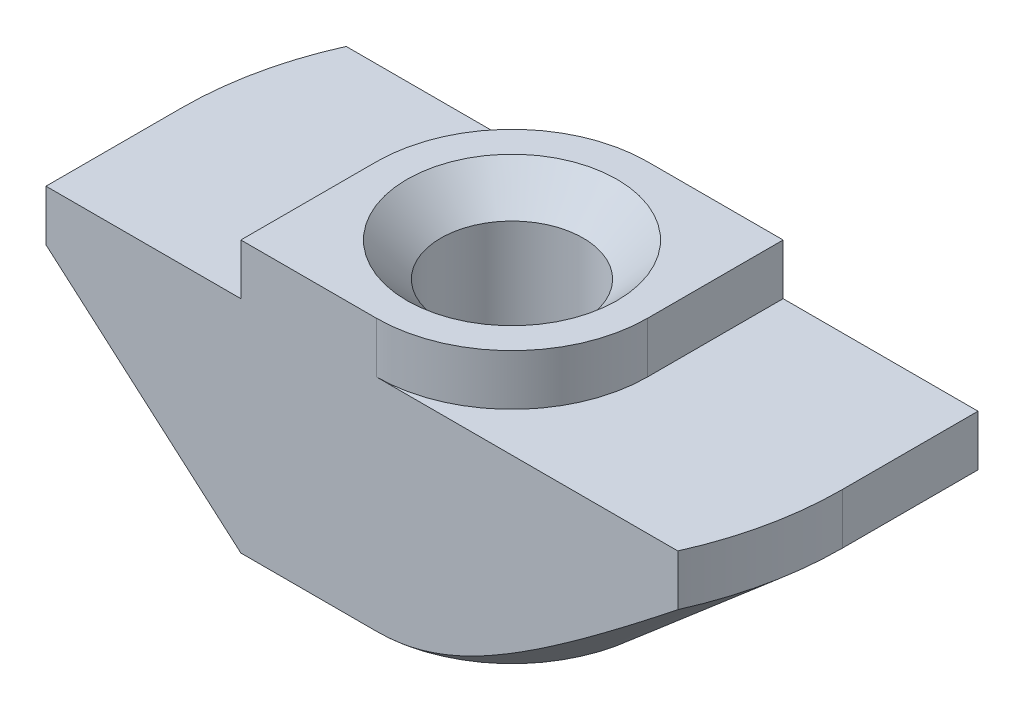
ISO-10303-21;
HEADER;
FILE_DESCRIPTION(('STEP AP214'),'2;1');
FILE_NAME('part.step','',(''),(''),'','','');
FILE_SCHEMA(('AUTOMOTIVE_DESIGN { 1 0 10303 214 1 1 1 1 }'));
ENDSEC;
DATA;
#1=APPLICATION_CONTEXT('core data for automotive mechanical design processes');
#2=APPLICATION_PROTOCOL_DEFINITION('international standard','automotive_design',2000,#1);
#3=PRODUCT_CONTEXT('',#1,'mechanical');
#4=PRODUCT('Part','Part','',(#3));
#5=PRODUCT_RELATED_PRODUCT_CATEGORY('part','',(#4));
#6=PRODUCT_DEFINITION_FORMATION('','',#4);
#7=PRODUCT_DEFINITION_CONTEXT('part definition',#1,'design');
#8=PRODUCT_DEFINITION('design','',#6,#7);
#9=PRODUCT_DEFINITION_SHAPE('','',#8);
#10=(LENGTH_UNIT() NAMED_UNIT(*) SI_UNIT(.MILLI.,.METRE.));
#11=(NAMED_UNIT(*) PLANE_ANGLE_UNIT() SI_UNIT($,.RADIAN.));
#12=(NAMED_UNIT(*) SI_UNIT($,.STERADIAN.) SOLID_ANGLE_UNIT());
#13=UNCERTAINTY_MEASURE_WITH_UNIT(LENGTH_MEASURE(1.E-05),#10,'distance_accuracy_value','');
#14=(GEOMETRIC_REPRESENTATION_CONTEXT(3) GLOBAL_UNCERTAINTY_ASSIGNED_CONTEXT((#13)) GLOBAL_UNIT_ASSIGNED_CONTEXT((#10,
#11,#12)) REPRESENTATION_CONTEXT('',''));
#15=CARTESIAN_POINT('',(0.,0.,0.));
#16=DIRECTION('',(0.,0.,1.));
#17=DIRECTION('',(1.,0.,0.));
#18=AXIS2_PLACEMENT_3D('',#15,#16,#17);
#19=CARTESIAN_POINT('',(-9.75,-1.5,4.));
#20=DIRECTION('',(1.,0.,0.));
#21=DIRECTION('',(0.,0.,-1.));
#22=AXIS2_PLACEMENT_3D('',#19,#20,#21);
#23=PLANE('',#22);
#24=DIRECTION('',(0.,0.,-1.));
#25=VECTOR('',#24,1.);
#26=CARTESIAN_POINT('',(-9.75,-3.,4.));
#27=LINE('',#26,#25);
#28=CARTESIAN_POINT('',(-9.75,-3.,4.));
#29=VERTEX_POINT('',#28);
#30=CARTESIAN_POINT('',(-9.75,-3.,0.));
#31=VERTEX_POINT('',#30);
#32=EDGE_CURVE('E316',#29,#31,#27,.T.);
#33=ORIENTED_EDGE('',*,*,#32,.F.);
#34=DIRECTION('',(0.,-1.,0.));
#35=VECTOR('',#34,1.);
#36=CARTESIAN_POINT('',(-9.75,-1.5,4.));
#37=LINE('',#36,#35);
#38=CARTESIAN_POINT('',(-9.75,-1.5,4.));
#39=VERTEX_POINT('',#38);
#40=EDGE_CURVE('E163',#39,#29,#37,.T.);
#41=ORIENTED_EDGE('',*,*,#40,.F.);
#42=DIRECTION('',(0.,0.,-1.));
#43=VECTOR('',#42,1.);
#44=CARTESIAN_POINT('',(-9.75,-1.5,4.));
#45=LINE('',#44,#43);
#46=CARTESIAN_POINT('',(-9.75,-1.5,0.));
#47=VERTEX_POINT('',#46);
#48=EDGE_CURVE('E45',#39,#47,#45,.T.);
#49=ORIENTED_EDGE('',*,*,#48,.T.);
#50=DIRECTION('',(0.,1.,0.));
#51=VECTOR('',#50,1.);
#52=CARTESIAN_POINT('',(-9.75,-8.,0.));
#53=LINE('',#52,#51);
#54=EDGE_CURVE('E209',#31,#47,#53,.T.);
#55=ORIENTED_EDGE('',*,*,#54,.F.);
#56=EDGE_LOOP('',(#33,#41,#49,#55));
#57=FACE_BOUND('',#56,.T.);
#58=ADVANCED_FACE('F37',(#57),#23,.F.);
#59=CARTESIAN_POINT('',(-9.75,-8.,4.));
#60=DIRECTION('',(0.,1.,0.));
#61=DIRECTION('',(0.,0.,1.));
#62=AXIS2_PLACEMENT_3D('',#59,#60,#61);
#63=PLANE('',#62);
#64=CARTESIAN_POINT('',(0.,-8.,0.));
#65=DIRECTION('',(0.,1.,0.));
#66=DIRECTION('',(0.,0.,1.));
#67=AXIS2_PLACEMENT_3D('',#64,#65,#66);
#68=CIRCLE('',#67,3.1);
#69=CARTESIAN_POINT('',(0.,-8.,3.1));
#70=VERTEX_POINT('',#69);
#71=EDGE_CURVE('E258',#70,#70,#68,.T.);
#72=ORIENTED_EDGE('',*,*,#71,.T.);
#73=EDGE_LOOP('',(#72));
#74=FACE_BOUND('',#73,.T.);
#75=DIRECTION('',(1.,0.,0.));
#76=VECTOR('',#75,1.);
#77=CARTESIAN_POINT('',(-9.75,-8.,4.));
#78=LINE('',#77,#76);
#79=CARTESIAN_POINT('',(-4.,-8.,4.));
#80=VERTEX_POINT('',#79);
#81=CARTESIAN_POINT('',(0.,-8.,4.));
#82=VERTEX_POINT('',#81);
#83=EDGE_CURVE('E161',#80,#82,#78,.T.);
#84=ORIENTED_EDGE('',*,*,#83,.F.);
#85=DIRECTION('',(0.,0.,-1.));
#86=VECTOR('',#85,1.);
#87=CARTESIAN_POINT('',(-4.,-8.,4.));
#88=LINE('',#87,#86);
#89=CARTESIAN_POINT('',(-4.,-8.,0.));
#90=VERTEX_POINT('',#89);
#91=EDGE_CURVE('E146',#80,#90,#88,.T.);
#92=ORIENTED_EDGE('',*,*,#91,.T.);
#93=CARTESIAN_POINT('',(0.,-8.,0.));
#94=DIRECTION('',(0.,-1.,0.));
#95=DIRECTION('',(-1.,0.,0.));
#96=AXIS2_PLACEMENT_3D('',#93,#94,#95);
#97=CIRCLE('',#96,4.);
#98=CARTESIAN_POINT('',(0.,-8.,-4.));
#99=VERTEX_POINT('',#98);
#100=EDGE_CURVE('E317',#90,#99,#97,.T.);
#101=ORIENTED_EDGE('',*,*,#100,.T.);
#102=DIRECTION('',(1.,0.,0.));
#103=VECTOR('',#102,1.);
#104=CARTESIAN_POINT('',(-9.75,-8.,-4.));
#105=LINE('',#104,#103);
#106=CARTESIAN_POINT('',(4.,-8.,-4.));
#107=VERTEX_POINT('',#106);
#108=EDGE_CURVE('E181',#99,#107,#105,.T.);
#109=ORIENTED_EDGE('',*,*,#108,.T.);
#110=DIRECTION('',(0.,0.,1.));
#111=VECTOR('',#110,1.);
#112=CARTESIAN_POINT('',(4.,-8.,-9.75));
#113=LINE('',#112,#111);
#114=CARTESIAN_POINT('',(4.,-8.,0.));
#115=VERTEX_POINT('',#114);
#116=EDGE_CURVE('E52',#107,#115,#113,.T.);
#117=ORIENTED_EDGE('',*,*,#116,.T.);
#118=CARTESIAN_POINT('',(0.,-8.,0.));
#119=DIRECTION('',(0.,-1.,0.));
#120=DIRECTION('',(1.,0.,0.));
#121=AXIS2_PLACEMENT_3D('',#118,#119,#120);
#122=CIRCLE('',#121,4.);
#123=EDGE_CURVE('E167',#115,#82,#122,.T.);
#124=ORIENTED_EDGE('',*,*,#123,.T.);
#125=EDGE_LOOP('',(#84,#92,#101,#109,#117,#124));
#126=FACE_BOUND('',#125,.T.);
#127=ADVANCED_FACE('F166',(#74,#126),#63,.F.);
#128=CARTESIAN_POINT('',(9.75,-1.5,4.));
#129=DIRECTION('',(-1.,0.,0.));
#130=DIRECTION('',(0.,0.,1.));
#131=AXIS2_PLACEMENT_3D('',#128,#129,#130);
#132=PLANE('',#131);
#133=DIRECTION('',(0.,0.,1.));
#134=VECTOR('',#133,1.);
#135=CARTESIAN_POINT('',(9.75,-3.,-9.75));
#136=LINE('',#135,#134);
#137=CARTESIAN_POINT('',(9.75,-3.,-4.));
#138=VERTEX_POINT('',#137);
#139=CARTESIAN_POINT('',(9.75,-3.,0.));
#140=VERTEX_POINT('',#139);
#141=EDGE_CURVE('E304',#138,#140,#136,.T.);
#142=ORIENTED_EDGE('',*,*,#141,.F.);
#143=DIRECTION('',(0.,1.,0.));
#144=VECTOR('',#143,1.);
#145=CARTESIAN_POINT('',(9.75,-1.5,-4.));
#146=LINE('',#145,#144);
#147=CARTESIAN_POINT('',(9.75,-1.5,-4.));
#148=VERTEX_POINT('',#147);
#149=EDGE_CURVE('E185',#138,#148,#146,.T.);
#150=ORIENTED_EDGE('',*,*,#149,.T.);
#151=DIRECTION('',(0.,0.,-1.));
#152=VECTOR('',#151,1.);
#153=CARTESIAN_POINT('',(9.75,-1.5,4.));
#154=LINE('',#153,#152);
#155=CARTESIAN_POINT('',(9.75,-1.5,0.));
#156=VERTEX_POINT('',#155);
#157=EDGE_CURVE('E203',#156,#148,#154,.T.);
#158=ORIENTED_EDGE('',*,*,#157,.F.);
#159=DIRECTION('',(0.,1.,0.));
#160=VECTOR('',#159,1.);
#161=CARTESIAN_POINT('',(9.75,-8.,0.));
#162=LINE('',#161,#160);
#163=EDGE_CURVE('E220',#140,#156,#162,.T.);
#164=ORIENTED_EDGE('',*,*,#163,.F.);
#165=EDGE_LOOP('',(#142,#150,#158,#164));
#166=FACE_BOUND('',#165,.T.);
#167=ADVANCED_FACE('F303',(#166),#132,.F.);
#168=CARTESIAN_POINT('',(0.,0.,4.));
#169=DIRECTION('',(0.,0.,-1.));
#170=DIRECTION('',(-1.,0.,0.));
#171=AXIS2_PLACEMENT_3D('',#168,#169,#170);
#172=PLANE('',#171);
#173=DIRECTION('',(-0.754605522163505,0.656178714924787,0.));
#174=VECTOR('',#173,1.);
#175=CARTESIAN_POINT('',(-4.,-8.,4.));
#176=LINE('',#175,#174);
#177=EDGE_CURVE('E149',#80,#29,#176,.T.);
#178=ORIENTED_EDGE('',*,*,#177,.F.);
#179=ORIENTED_EDGE('',*,*,#83,.T.);
#180=CARTESIAN_POINT('',(19.0930125034409,5.48479531743841,4.));
#181=CARTESIAN_POINT('',(18.5778133169644,5.04634478096504,4.));
#182=CARTESIAN_POINT('',(18.0622729802475,4.60829381291386,4.));
#183=CARTESIAN_POINT('',(17.0302280235104,3.73329525980051,4.));
#184=CARTESIAN_POINT('',(16.5137233725138,3.29634771128181,4.));
#185=CARTESIAN_POINT('',(15.47863444366,2.42315755061796,4.));
#186=CARTESIAN_POINT('',(14.9600481309705,1.98691734873569,4.));
#187=CARTESIAN_POINT('',(13.9212553406501,1.11639739796508,4.));
#188=CARTESIAN_POINT('',(13.401048906075,0.682117597716457,4.));
#189=CARTESIAN_POINT('',(12.3246773818503,-0.21175731208505,4.));
#190=CARTESIAN_POINT('',(11.7683628761931,-0.671172901903966,4.));
#191=CARTESIAN_POINT('',(10.9310662928984,-1.35689819172363,4.));
#192=CARTESIAN_POINT('',(10.6514842055428,-1.58491694423187,4.));
#193=CARTESIAN_POINT('',(10.0911578682021,-2.03952130793857,4.));
#194=CARTESIAN_POINT('',(9.81041362223716,-2.26610692408762,4.));
#195=CARTESIAN_POINT('',(9.24775627916612,-2.71723925573111,4.));
#196=CARTESIAN_POINT('',(8.96584464993702,-2.94178780024051,4.));
#197=CARTESIAN_POINT('',(8.40017784545761,-3.38854835363034,4.));
#198=CARTESIAN_POINT('',(8.11642269007676,-3.61076038762625,4.));
#199=CARTESIAN_POINT('',(7.54655666760194,-4.05206638411712,4.));
#200=CARTESIAN_POINT('',(7.26044612879617,-4.27116076990599,4.));
#201=CARTESIAN_POINT('',(6.68506947716327,-4.70515877749395,4.));
#202=CARTESIAN_POINT('',(6.39580350808307,-4.92006258896335,4.));
#203=CARTESIAN_POINT('',(5.94380391200236,-5.24880354329621,4.));
#204=CARTESIAN_POINT('',(5.7825678290859,-5.3646987592163,4.));
#205=CARTESIAN_POINT('',(5.45852078349081,-5.59427839205067,4.));
#206=CARTESIAN_POINT('',(5.29570978752578,-5.70796276208432,4.));
#207=CARTESIAN_POINT('',(4.96801437116113,-5.93271086070198,4.));
#208=CARTESIAN_POINT('',(4.80312782045187,-6.04377149083704,4.));
#209=CARTESIAN_POINT('',(4.47106545917387,-6.26241638816355,4.));
#210=CARTESIAN_POINT('',(4.3038897228336,-6.37000076769662,4.));
#211=CARTESIAN_POINT('',(3.96779734207744,-6.58006534355457,4.));
#212=CARTESIAN_POINT('',(3.79889805399672,-6.68257318482784,4.));
#213=CARTESIAN_POINT('',(3.45771491043147,-6.88190221849361,4.));
#214=CARTESIAN_POINT('',(3.28543046434657,-6.97872240660534,4.));
#215=CARTESIAN_POINT('',(2.93709738155444,-7.1646860244681,4.));
#216=CARTESIAN_POINT('',(2.76105538763457,-7.25384179412908,4.));
#217=CARTESIAN_POINT('',(2.40427915744407,-7.42212304050504,4.));
#218=CARTESIAN_POINT('',(2.22354728037757,-7.50125344690475,4.));
#219=CARTESIAN_POINT('',(1.87877415331493,-7.6374635749479,4.));
#220=CARTESIAN_POINT('',(1.71533550918919,-7.69605023700292,4.));
#221=CARTESIAN_POINT('',(1.3842626600524,-7.80005250313673,4.));
#222=CARTESIAN_POINT('',(1.21662899480356,-7.84546979231455,4.));
#223=CARTESIAN_POINT('',(0.879640019068342,-7.9196719407948,4.));
#224=CARTESIAN_POINT('',(0.710326071439545,-7.94864036786479,4.));
#225=CARTESIAN_POINT('',(0.369553218503112,-7.9882685957749,4.));
#226=CARTESIAN_POINT('',(0.198094873403108,-7.99893308174377,4.));
#227=CARTESIAN_POINT('',(-0.14622215115853,-8.00092076503876,4.));
#228=CARTESIAN_POINT('',(-0.319081718741123,-7.9920988065105,4.));
#229=CARTESIAN_POINT('',(-0.66279617162969,-7.95570116318786,4.));
#230=CARTESIAN_POINT('',(-0.833650530135947,-7.92812065766392,4.));
#231=CARTESIAN_POINT('',(-1.17380899940443,-7.85620687940474,4.));
#232=CARTESIAN_POINT('',(-1.34307188352269,-7.811682245836,4.));
#233=CARTESIAN_POINT('',(-1.59373756175264,-7.73469658263694,4.));
#234=CARTESIAN_POINT('',(-1.67676247755531,-7.70733179971942,4.));
#235=CARTESIAN_POINT('',(-1.8417517988474,-7.6495708706268,4.));
#236=CARTESIAN_POINT('',(-1.92371622948916,-7.6191747964966,4.));
#237=CARTESIAN_POINT('',(-2.13504326669252,-7.53682619979317,4.));
#238=CARTESIAN_POINT('',(-2.26359986699921,-7.48280578099689,4.));
#239=CARTESIAN_POINT('',(-2.51824420204764,-7.36919866655113,4.));
#240=CARTESIAN_POINT('',(-2.64433129566204,-7.3096105480052,4.));
#241=CARTESIAN_POINT('',(-2.89436868902728,-7.18584959519642,4.));
#242=CARTESIAN_POINT('',(-3.01831691948272,-7.12167259961822,4.));
#243=CARTESIAN_POINT('',(-3.26422266973225,-6.98960098632555,4.));
#244=CARTESIAN_POINT('',(-3.38617997843972,-6.92170597769097,4.));
#245=CARTESIAN_POINT('',(-3.75029646649663,-6.71298185031499,4.));
#246=CARTESIAN_POINT('',(-3.98982159172294,-6.56756033192358,4.));
#247=CARTESIAN_POINT('',(-4.46340938681992,-6.26843578703017,4.));
#248=CARTESIAN_POINT('',(-4.69747464234275,-6.11473679951732,4.));
#249=CARTESIAN_POINT('',(-5.16321438853325,-5.80025182347771,4.));
#250=CARTESIAN_POINT('',(-5.39485991399544,-5.63942310121265,4.));
#251=CARTESIAN_POINT('',(-5.85502306619878,-5.31332270165477,4.));
#252=CARTESIAN_POINT('',(-6.08354037524194,-5.14805057807379,4.));
#253=CARTESIAN_POINT('',(-6.53765735729361,-4.81451787561935,4.));
#254=CARTESIAN_POINT('',(-6.76326204804518,-4.64626411196043,4.));
#255=CARTESIAN_POINT('',(-7.21253368666862,-4.3072099865075,4.));
#256=CARTESIAN_POINT('',(-7.43620070078051,-4.13640971231412,4.));
#257=CARTESIAN_POINT('',(-7.87440605894757,-3.79864870939196,4.));
#258=CARTESIAN_POINT('',(-8.08899613000098,-3.6317549946429,4.));
#259=CARTESIAN_POINT('',(-8.51708866686722,-3.29638802975018,4.));
#260=CARTESIAN_POINT('',(-8.73059061658266,-3.12791412140789,4.));
#261=CARTESIAN_POINT('',(-9.15412189702873,-2.79172022690956,4.));
#262=CARTESIAN_POINT('',(-9.36416259813433,-2.62401455116661,4.));
#263=CARTESIAN_POINT('',(-9.78334542346964,-2.28767615731866,4.));
#264=CARTESIAN_POINT('',(-9.99248790937981,-2.11904389012149,4.));
#265=CARTESIAN_POINT('',(-10.2013028815516,-1.95000895828563,4.));
#266=B_SPLINE_CURVE_WITH_KNOTS('',3,(#180,#181,#182,#183,#184,#185,#186,#187,#188,#189,#190,
#191,#192,#193,#194,#195,#196,#197,#198,#199,#200,#201,#202,#203,#204,#205,#206,#207,#208,#209,
#210,#211,#212,#213,#214,#215,#216,#217,#218,#219,#220,#221,#222,#223,#224,#225,#226,#227,#228,
#229,#230,#231,#232,#233,#234,#235,#236,#237,#238,#239,#240,#241,#242,#243,#244,#245,#246,#247,
#248,#249,#250,#251,#252,#253,#254,#255,#256,#257,#258,#259,#260,#261,#262,#263,#264,#265),
.UNSPECIFIED.,.F.,.F.,(4,2,2,2,2,2,2,2,2,2,2,2,2,2,2,2,2,2,2,2,2,2,2,2,2,2,2,2,2,2,2,2,2,2,2,2,
2,2,2,2,2,2,4),(0.,2.02953833455181,4.05914302502208,6.09215065585671,8.12510471143518,
10.2895570428798,11.371878906685,12.4541970297015,13.535421419087,14.6166341743324,
15.6976987012863,16.7787141838814,17.3744003174641,17.9700990687338,18.5664692951226,
19.1628202293636,19.7554524823498,20.3481890650503,20.9399527193616,21.5314242521027,
22.0518540383534,22.572217203124,23.086652881933,23.6009568646764,24.1191048434135,
24.637386030525,25.1617030827551,25.4239118441335,25.6861143750633,26.1042775249438,
26.5225478355647,26.9412023765355,27.3599010206039,28.2002514013315,29.0401953843998,
29.8861310854953,30.7321520707985,31.576440022776,32.4206989977375,33.236240856672,
34.052139001134,34.8584735236023,35.6644453613211),.UNSPECIFIED.);
#267=CARTESIAN_POINT('',(8.89170962188937,-3.,4.));
#268=VERTEX_POINT('',#267);
#269=EDGE_CURVE('E321',#268,#82,#266,.T.);
#270=ORIENTED_EDGE('',*,*,#269,.F.);
#271=DIRECTION('',(0.,1.,0.));
#272=VECTOR('',#271,1.);
#273=CARTESIAN_POINT('',(8.89170962188937,-8.,4.));
#274=LINE('',#273,#272);
#275=CARTESIAN_POINT('',(8.89170962188937,-1.5,4.));
#276=VERTEX_POINT('',#275);
#277=EDGE_CURVE('E223',#268,#276,#274,.T.);
#278=ORIENTED_EDGE('',*,*,#277,.T.);
#279=DIRECTION('',(-1.,0.,0.));
#280=VECTOR('',#279,1.);
#281=CARTESIAN_POINT('',(4.,-1.5,4.));
#282=LINE('',#281,#280);
#283=CARTESIAN_POINT('',(0.,-1.5,4.));
#284=VERTEX_POINT('',#283);
#285=EDGE_CURVE('E168',#276,#284,#282,.T.);
#286=ORIENTED_EDGE('',*,*,#285,.T.);
#287=DIRECTION('',(0.,1.,0.));
#288=VECTOR('',#287,1.);
#289=CARTESIAN_POINT('',(0.,-7.15685424949238,4.));
#290=LINE('',#289,#288);
#291=CARTESIAN_POINT('',(0.,0.,4.));
#292=VERTEX_POINT('',#291);
#293=EDGE_CURVE('E246',#284,#292,#290,.T.);
#294=ORIENTED_EDGE('',*,*,#293,.T.);
#295=DIRECTION('',(-1.,0.,0.));
#296=VECTOR('',#295,1.);
#297=CARTESIAN_POINT('',(4.,0.,4.));
#298=LINE('',#297,#296);
#299=CARTESIAN_POINT('',(-4.,0.,4.));
#300=VERTEX_POINT('',#299);
#301=EDGE_CURVE('E170',#292,#300,#298,.T.);
#302=ORIENTED_EDGE('',*,*,#301,.T.);
#303=DIRECTION('',(0.,-1.,0.));
#304=VECTOR('',#303,1.);
#305=CARTESIAN_POINT('',(-4.,0.,4.));
#306=LINE('',#305,#304);
#307=CARTESIAN_POINT('',(-4.,-1.5,4.));
#308=VERTEX_POINT('',#307);
#309=EDGE_CURVE('E196',#300,#308,#306,.T.);
#310=ORIENTED_EDGE('',*,*,#309,.T.);
#311=DIRECTION('',(-1.,0.,0.));
#312=VECTOR('',#311,1.);
#313=CARTESIAN_POINT('',(-4.,-1.5,4.));
#314=LINE('',#313,#312);
#315=EDGE_CURVE('E172',#308,#39,#314,.T.);
#316=ORIENTED_EDGE('',*,*,#315,.T.);
#317=ORIENTED_EDGE('',*,*,#40,.T.);
#318=EDGE_LOOP('',(#178,#179,#270,#278,#286,#294,#302,#310,#316,#317));
#319=FACE_BOUND('',#318,.T.);
#320=ADVANCED_FACE('F159',(#319),#172,.F.);
#321=CARTESIAN_POINT('',(0.,0.,-4.));
#322=DIRECTION('',(0.,0.,-1.));
#323=DIRECTION('',(-1.,0.,0.));
#324=AXIS2_PLACEMENT_3D('',#321,#322,#323);
#325=PLANE('',#324);
#326=ORIENTED_EDGE('',*,*,#108,.F.);
#327=CARTESIAN_POINT('',(10.2013028815516,-1.95000895828561,-4.));
#328=CARTESIAN_POINT('',(10.0339198393362,-2.08551143614665,-4.));
#329=CARTESIAN_POINT('',(9.86632283217457,-2.2207499092589,-4.));
#330=CARTESIAN_POINT('',(9.5306291113076,-2.49060788617074,-4.));
#331=CARTESIAN_POINT('',(9.3625323935981,-2.6252273849884,-4.));
#332=CARTESIAN_POINT('',(8.85711014174881,-3.02824011005636,-4.));
#333=CARTESIAN_POINT('',(8.51892952893781,-3.29556281198958,-4.));
#334=CARTESIAN_POINT('',(7.82606328189803,-3.83681323070731,-4.));
#335=CARTESIAN_POINT('',(7.47125417808717,-4.11058357354471,-4.));
#336=CARTESIAN_POINT('',(6.93566544519761,-4.51652980873558,-4.));
#337=CARTESIAN_POINT('',(6.75663624561629,-4.65101435659177,-4.));
#338=CARTESIAN_POINT('',(6.39716787276301,-4.91808381202073,-4.));
#339=CARTESIAN_POINT('',(6.21672871850456,-5.05066874514209,-4.));
#340=CARTESIAN_POINT('',(5.85418369277563,-5.31345193555315,-4.));
#341=CARTESIAN_POINT('',(5.67207823226353,-5.44365075874076,-4.));
#342=CARTESIAN_POINT('',(5.30576731880303,-5.70107997472775,-4.));
#343=CARTESIAN_POINT('',(5.12156180206058,-5.82831027699185,-4.));
#344=CARTESIAN_POINT('',(4.75011127026993,-6.07925940964712,-4.));
#345=CARTESIAN_POINT('',(4.56285994512742,-6.20296893308306,-4.));
#346=CARTESIAN_POINT('',(4.18513224883839,-6.44535805808298,-4.));
#347=CARTESIAN_POINT('',(3.99465611805763,-6.56403803224218,-4.));
#348=CARTESIAN_POINT('',(3.61304128488062,-6.79266272765141,-4.));
#349=CARTESIAN_POINT('',(3.42197306424269,-6.90272431468641,-4.));
#350=CARTESIAN_POINT('',(3.03491286140894,-7.11411820657794,-4.));
#351=CARTESIAN_POINT('',(2.83891889996064,-7.21544692756372,-4.));
#352=CARTESIAN_POINT('',(2.44192184290774,-7.40560938726516,-4.));
#353=CARTESIAN_POINT('',(2.24094385599254,-7.49449488615489,-4.));
#354=CARTESIAN_POINT('',(1.8325063106098,-7.65562668554541,-4.));
#355=CARTESIAN_POINT('',(1.62505480048051,-7.72789278037345,-4.));
#356=CARTESIAN_POINT('',(1.27981814559727,-7.82796451166703,-4.));
#357=CARTESIAN_POINT('',(1.14396110792812,-7.86239848800736,-4.));
#358=CARTESIAN_POINT('',(0.869910445029896,-7.92056970940938,-4.));
#359=CARTESIAN_POINT('',(0.731716453760718,-7.94430526235705,-4.));
#360=CARTESIAN_POINT('',(0.454464556175093,-7.97964173047544,-4.));
#361=CARTESIAN_POINT('',(0.315414459383221,-7.99130291119976,-4.));
#362=CARTESIAN_POINT('',(0.0368276951767137,-8.0019571726022,-4.));
#363=CARTESIAN_POINT('',(-0.102708943731008,-8.00095098340584,-4.));
#364=CARTESIAN_POINT('',(-0.38098249054024,-7.9863455393582,-4.));
#365=CARTESIAN_POINT('',(-0.519720005408902,-7.97275762445244,-4.));
#366=CARTESIAN_POINT('',(-0.795526149407617,-7.93385441309408,-4.));
#367=CARTESIAN_POINT('',(-0.932594595612336,-7.90853784287634,-4.));
#368=CARTESIAN_POINT('',(-1.20518982051904,-7.84736843394937,-4.));
#369=CARTESIAN_POINT('',(-1.34070240327483,-7.81145325217638,-4.));
#370=CARTESIAN_POINT('',(-1.60900813965177,-7.73074156625156,-4.));
#371=CARTESIAN_POINT('',(-1.74180146424736,-7.68594562238459,-4.));
#372=CARTESIAN_POINT('',(-2.06774555470206,-7.56574973434711,-4.));
#373=CARTESIAN_POINT('',(-2.25927747683547,-7.48597990119863,-4.));
#374=CARTESIAN_POINT('',(-2.63698467897033,-7.31453077262157,-4.));
#375=CARTESIAN_POINT('',(-2.82315606434946,-7.22284307246944,-4.));
#376=CARTESIAN_POINT('',(-3.19133344589281,-7.0304609141347,-4.));
#377=CARTESIAN_POINT('',(-3.37332794720551,-6.92974465007832,-4.));
#378=CARTESIAN_POINT('',(-3.7334477915038,-6.72176852295224,-4.));
#379=CARTESIAN_POINT('',(-3.91157408445031,-6.6145102916867,-4.));
#380=CARTESIAN_POINT('',(-4.26690326443273,-6.39365749074014,-4.));
#381=CARTESIAN_POINT('',(-4.444067421961,-6.2800009179053,-4.));
#382=CARTESIAN_POINT('',(-4.79581550110569,-6.0487604594614,-4.));
#383=CARTESIAN_POINT('',(-4.97039930014717,-5.93117638814353,-4.));
#384=CARTESIAN_POINT('',(-5.31718243657692,-5.69312760113897,-4.));
#385=CARTESIAN_POINT('',(-5.48938509058574,-5.57266770382255,-4.));
#386=CARTESIAN_POINT('',(-5.832052772288,-5.32931648933681,-4.));
#387=CARTESIAN_POINT('',(-6.0025178459933,-5.20642523680557,-4.));
#388=CARTESIAN_POINT('',(-6.46417550999881,-4.86955059087449,-4.));
#389=CARTESIAN_POINT('',(-6.75397131864408,-4.6536542948738,-4.));
#390=CARTESIAN_POINT('',(-7.33046309681157,-4.217755036655,-4.));
#391=CARTESIAN_POINT('',(-7.61715893303351,-3.99775189894105,-4.));
#392=CARTESIAN_POINT('',(-8.18823393079153,-3.55468662675595,-4.));
#393=CARTESIAN_POINT('',(-8.47261278287653,-3.33162409401831,-4.));
#394=CARTESIAN_POINT('',(-9.03955595713135,-2.88320266419135,-4.));
#395=CARTESIAN_POINT('',(-9.32212026063873,-2.6578437435454,-4.));
#396=CARTESIAN_POINT('',(-9.886143453162,-2.20508818164028,-4.));
#397=CARTESIAN_POINT('',(-10.1676007023281,-1.97768949943048,-4.));
#398=CARTESIAN_POINT('',(-10.7293691975362,-1.52148028275231,-4.));
#399=CARTESIAN_POINT('',(-11.0096804397628,-1.29266974358973,-4.));
#400=CARTESIAN_POINT('',(-11.8491851542355,-0.604591320533747,-4.));
#401=CARTESIAN_POINT('',(-12.4069971523932,-0.143638301746192,-4.));
#402=CARTESIAN_POINT('',(-13.4777900145884,0.746108447391972,-4.));
#403=CARTESIAN_POINT('',(-13.9909542215763,1.17468201561434,-4.));
#404=CARTESIAN_POINT('',(-15.0157237514183,2.03371405569384,-4.));
#405=CARTESIAN_POINT('',(-15.5273290352433,2.46417257409544,-4.));
#406=CARTESIAN_POINT('',(-16.5484683455278,3.32572688529102,-4.));
#407=CARTESIAN_POINT('',(-17.0580044304759,3.7568202401299,-4.));
#408=CARTESIAN_POINT('',(-18.0761421237496,4.6200775417147,-4.));
#409=CARTESIAN_POINT('',(-18.5847437603499,5.05224145510645,-4.));
#410=CARTESIAN_POINT('',(-19.0930125034409,5.48479531743842,-4.));
#411=B_SPLINE_CURVE_WITH_KNOTS('',3,(#327,#328,#329,#330,#331,#332,#333,#334,#335,#336,#337,
#338,#339,#340,#341,#342,#343,#344,#345,#346,#347,#348,#349,#350,#351,#352,#353,#354,#355,#356,
#357,#358,#359,#360,#361,#362,#363,#364,#365,#366,#367,#368,#369,#370,#371,#372,#373,#374,#375,
#376,#377,#378,#379,#380,#381,#382,#383,#384,#385,#386,#387,#388,#389,#390,#391,#392,#393,#394,
#395,#396,#397,#398,#399,#400,#401,#402,#403,#404,#405,#406,#407,#408,#409,#410),.UNSPECIFIED.,
.F.,.F.,(4,2,2,2,2,2,2,2,2,2,2,2,2,2,2,2,2,2,2,2,2,2,2,2,2,2,2,2,2,2,2,2,2,2,2,2,2,2,2,2,2,4),
(0.,0.646066469562852,1.29213813004586,2.58535159892046,3.92975214476226,4.60148503690557,
5.27320888617807,5.94477130988362,6.6163541884943,7.28957271997509,7.96274129110434,
8.6240786797822,9.28568619424606,9.94445418525195,10.6024334479883,11.0225346289763,
11.442702231889,11.8607624364611,12.2787985448689,12.6964582424969,13.1141633097869,
13.5343761117408,13.9545624110161,14.576405787849,15.1986901050663,15.8225200909053,
16.4461951022656,17.0775908972504,17.709016589694,18.3394497925658,18.9698662577038,
20.0539373371927,21.1380548483351,22.2223148532865,23.3065859919301,24.3921009102971,
25.4776194397949,27.6484733081619,29.6542390606716,31.6600546233868,33.6623558511828,
35.6645954610344),.UNSPECIFIED.);
#412=CARTESIAN_POINT('',(-8.89170962188937,-3.,-4.));
#413=VERTEX_POINT('',#412);
#414=EDGE_CURVE('E227',#99,#413,#411,.T.);
#415=ORIENTED_EDGE('',*,*,#414,.T.);
#416=DIRECTION('',(0.,1.,0.));
#417=VECTOR('',#416,1.);
#418=CARTESIAN_POINT('',(-8.89170962188937,-8.,-4.));
#419=LINE('',#418,#417);
#420=CARTESIAN_POINT('',(-8.89170962188937,-1.5,-4.));
#421=VERTEX_POINT('',#420);
#422=EDGE_CURVE('E219',#413,#421,#419,.T.);
#423=ORIENTED_EDGE('',*,*,#422,.T.);
#424=DIRECTION('',(-1.,0.,0.));
#425=VECTOR('',#424,1.);
#426=CARTESIAN_POINT('',(-4.,-1.5,-4.));
#427=LINE('',#426,#425);
#428=CARTESIAN_POINT('',(0.,-1.5,-4.));
#429=VERTEX_POINT('',#428);
#430=EDGE_CURVE('E178',#429,#421,#427,.T.);
#431=ORIENTED_EDGE('',*,*,#430,.F.);
#432=DIRECTION('',(0.,1.,0.));
#433=VECTOR('',#432,1.);
#434=CARTESIAN_POINT('',(0.,-7.15685424949238,-4.));
#435=LINE('',#434,#433);
#436=CARTESIAN_POINT('',(0.,0.,-4.));
#437=VERTEX_POINT('',#436);
#438=EDGE_CURVE('E255',#429,#437,#435,.T.);
#439=ORIENTED_EDGE('',*,*,#438,.T.);
#440=DIRECTION('',(-1.,0.,0.));
#441=VECTOR('',#440,1.);
#442=CARTESIAN_POINT('',(4.,0.,-4.));
#443=LINE('',#442,#441);
#444=CARTESIAN_POINT('',(4.,0.,-4.));
#445=VERTEX_POINT('',#444);
#446=EDGE_CURVE('E193',#445,#437,#443,.T.);
#447=ORIENTED_EDGE('',*,*,#446,.F.);
#448=DIRECTION('',(0.,1.,0.));
#449=VECTOR('',#448,1.);
#450=CARTESIAN_POINT('',(4.,0.,-4.));
#451=LINE('',#450,#449);
#452=CARTESIAN_POINT('',(4.,-1.5,-4.));
#453=VERTEX_POINT('',#452);
#454=EDGE_CURVE('E190',#453,#445,#451,.T.);
#455=ORIENTED_EDGE('',*,*,#454,.F.);
#456=DIRECTION('',(-1.,0.,0.));
#457=VECTOR('',#456,1.);
#458=CARTESIAN_POINT('',(4.,-1.5,-4.));
#459=LINE('',#458,#457);
#460=EDGE_CURVE('E187',#148,#453,#459,.T.);
#461=ORIENTED_EDGE('',*,*,#460,.F.);
#462=ORIENTED_EDGE('',*,*,#149,.F.);
#463=DIRECTION('',(-0.754605522163505,-0.656178714924787,0.));
#464=VECTOR('',#463,1.);
#465=CARTESIAN_POINT('',(5.68353067814855,-6.53606027987083,-4.));
#466=LINE('',#465,#464);
#467=EDGE_CURVE('E313',#138,#107,#466,.T.);
#468=ORIENTED_EDGE('',*,*,#467,.T.);
#469=EDGE_LOOP('',(#326,#415,#423,#431,#439,#447,#455,#461,#462,#468));
#470=FACE_BOUND('',#469,.T.);
#471=ADVANCED_FACE('F283',(#470),#325,.T.);
#472=CARTESIAN_POINT('',(0.,-8.,0.));
#473=DIRECTION('',(0.,1.,0.));
#474=DIRECTION('',(-1.,0.,0.));
#475=AXIS2_PLACEMENT_3D('',#472,#473,#474);
#476=CYLINDRICAL_SURFACE('',#475,9.75);
#477=CARTESIAN_POINT('',(0.,-3.,0.));
#478=DIRECTION('',(0.,-1.,0.));
#479=DIRECTION('',(-1.,0.,0.));
#480=AXIS2_PLACEMENT_3D('',#477,#478,#479);
#481=CIRCLE('',#480,9.75);
#482=EDGE_CURVE('E60',#31,#413,#481,.T.);
#483=ORIENTED_EDGE('',*,*,#482,.F.);
#484=ORIENTED_EDGE('',*,*,#54,.T.);
#485=CARTESIAN_POINT('',(0.,-1.5,0.));
#486=DIRECTION('',(0.,-1.,0.));
#487=DIRECTION('',(-1.,0.,0.));
#488=AXIS2_PLACEMENT_3D('',#485,#486,#487);
#489=CIRCLE('',#488,9.75);
#490=EDGE_CURVE('E215',#47,#421,#489,.T.);
#491=ORIENTED_EDGE('',*,*,#490,.T.);
#492=ORIENTED_EDGE('',*,*,#422,.F.);
#493=EDGE_LOOP('',(#483,#484,#491,#492));
#494=FACE_BOUND('',#493,.T.);
#495=ADVANCED_FACE('F344',(#494),#476,.T.);
#496=CARTESIAN_POINT('',(0.,-8.,0.));
#497=DIRECTION('',(0.,1.,0.));
#498=DIRECTION('',(-1.,0.,0.));
#499=AXIS2_PLACEMENT_3D('',#496,#497,#498);
#500=CYLINDRICAL_SURFACE('',#499,9.75);
#501=CARTESIAN_POINT('',(0.,-3.,0.));
#502=DIRECTION('',(0.,-1.,0.));
#503=DIRECTION('',(1.,0.,0.));
#504=AXIS2_PLACEMENT_3D('',#501,#502,#503);
#505=CIRCLE('',#504,9.75);
#506=EDGE_CURVE('E309',#140,#268,#505,.T.);
#507=ORIENTED_EDGE('',*,*,#506,.F.);
#508=ORIENTED_EDGE('',*,*,#163,.T.);
#509=CARTESIAN_POINT('',(0.,-1.5,0.));
#510=DIRECTION('',(0.,-1.,0.));
#511=DIRECTION('',(1.,0.,0.));
#512=AXIS2_PLACEMENT_3D('',#509,#510,#511);
#513=CIRCLE('',#512,9.75);
#514=EDGE_CURVE('E237',#156,#276,#513,.T.);
#515=ORIENTED_EDGE('',*,*,#514,.T.);
#516=ORIENTED_EDGE('',*,*,#277,.F.);
#517=EDGE_LOOP('',(#507,#508,#515,#516));
#518=FACE_BOUND('',#517,.T.);
#519=ADVANCED_FACE('F347',(#518),#500,.T.);
#520=CARTESIAN_POINT('',(-4.,0.,4.));
#521=DIRECTION('',(1.,0.,0.));
#522=DIRECTION('',(0.,0.,-1.));
#523=AXIS2_PLACEMENT_3D('',#520,#521,#522);
#524=PLANE('',#523);
#525=DIRECTION('',(0.,0.,-1.));
#526=VECTOR('',#525,1.);
#527=CARTESIAN_POINT('',(-4.,0.,4.));
#528=LINE('',#527,#526);
#529=CARTESIAN_POINT('',(-4.,0.,0.));
#530=VERTEX_POINT('',#529);
#531=EDGE_CURVE('E177',#300,#530,#528,.T.);
#532=ORIENTED_EDGE('',*,*,#531,.T.);
#533=DIRECTION('',(0.,1.,0.));
#534=VECTOR('',#533,1.);
#535=CARTESIAN_POINT('',(-4.,-7.15685424949238,0.));
#536=LINE('',#535,#534);
#537=CARTESIAN_POINT('',(-4.,-1.5,0.));
#538=VERTEX_POINT('',#537);
#539=EDGE_CURVE('E252',#538,#530,#536,.T.);
#540=ORIENTED_EDGE('',*,*,#539,.F.);
#541=DIRECTION('',(0.,0.,-1.));
#542=VECTOR('',#541,1.);
#543=CARTESIAN_POINT('',(-4.,-1.5,4.));
#544=LINE('',#543,#542);
#545=EDGE_CURVE('E11',#308,#538,#544,.T.);
#546=ORIENTED_EDGE('',*,*,#545,.F.);
#547=ORIENTED_EDGE('',*,*,#309,.F.);
#548=EDGE_LOOP('',(#532,#540,#546,#547));
#549=FACE_BOUND('',#548,.T.);
#550=ADVANCED_FACE('F39',(#549),#524,.F.);
#551=CARTESIAN_POINT('',(-4.,-1.5,4.));
#552=DIRECTION('',(0.,-1.,0.));
#553=DIRECTION('',(1.,0.,0.));
#554=AXIS2_PLACEMENT_3D('',#551,#552,#553);
#555=PLANE('',#554);
#556=ORIENTED_EDGE('',*,*,#430,.T.);
#557=ORIENTED_EDGE('',*,*,#490,.F.);
#558=ORIENTED_EDGE('',*,*,#48,.F.);
#559=ORIENTED_EDGE('',*,*,#315,.F.);
#560=ORIENTED_EDGE('',*,*,#545,.T.);
#561=CARTESIAN_POINT('',(0.,-1.5,0.));
#562=DIRECTION('',(0.,-1.,0.));
#563=DIRECTION('',(1.,0.,0.));
#564=AXIS2_PLACEMENT_3D('',#561,#562,#563);
#565=CIRCLE('',#564,4.);
#566=EDGE_CURVE('E253',#538,#429,#565,.T.);
#567=ORIENTED_EDGE('',*,*,#566,.T.);
#568=EDGE_LOOP('',(#556,#557,#558,#559,#560,#567));
#569=FACE_BOUND('',#568,.T.);
#570=ADVANCED_FACE('F212',(#569),#555,.F.);
#571=CARTESIAN_POINT('',(4.,-1.5,4.));
#572=DIRECTION('',(0.,-1.,0.));
#573=DIRECTION('',(1.,0.,0.));
#574=AXIS2_PLACEMENT_3D('',#571,#572,#573);
#575=PLANE('',#574);
#576=ORIENTED_EDGE('',*,*,#285,.F.);
#577=ORIENTED_EDGE('',*,*,#514,.F.);
#578=ORIENTED_EDGE('',*,*,#157,.T.);
#579=ORIENTED_EDGE('',*,*,#460,.T.);
#580=DIRECTION('',(0.,0.,-1.));
#581=VECTOR('',#580,1.);
#582=CARTESIAN_POINT('',(4.,-1.5,4.));
#583=LINE('',#582,#581);
#584=CARTESIAN_POINT('',(4.,-1.5,0.));
#585=VERTEX_POINT('',#584);
#586=EDGE_CURVE('E201',#585,#453,#583,.T.);
#587=ORIENTED_EDGE('',*,*,#586,.F.);
#588=CARTESIAN_POINT('',(0.,-1.5,0.));
#589=DIRECTION('',(0.,-1.,0.));
#590=DIRECTION('',(1.,0.,0.));
#591=AXIS2_PLACEMENT_3D('',#588,#589,#590);
#592=CIRCLE('',#591,4.);
#593=EDGE_CURVE('E243',#585,#284,#592,.T.);
#594=ORIENTED_EDGE('',*,*,#593,.T.);
#595=EDGE_LOOP('',(#576,#577,#578,#579,#587,#594));
#596=FACE_BOUND('',#595,.T.);
#597=ADVANCED_FACE('F297',(#596),#575,.F.);
#598=CARTESIAN_POINT('',(4.,0.,4.));
#599=DIRECTION('',(-1.,0.,0.));
#600=DIRECTION('',(0.,0.,1.));
#601=AXIS2_PLACEMENT_3D('',#598,#599,#600);
#602=PLANE('',#601);
#603=DIRECTION('',(0.,0.,-1.));
#604=VECTOR('',#603,1.);
#605=CARTESIAN_POINT('',(4.,0.,4.));
#606=LINE('',#605,#604);
#607=CARTESIAN_POINT('',(4.,0.,0.));
#608=VERTEX_POINT('',#607);
#609=EDGE_CURVE('E199',#608,#445,#606,.T.);
#610=ORIENTED_EDGE('',*,*,#609,.F.);
#611=DIRECTION('',(0.,1.,0.));
#612=VECTOR('',#611,1.);
#613=CARTESIAN_POINT('',(4.,-7.15685424949238,0.));
#614=LINE('',#613,#612);
#615=EDGE_CURVE('E242',#585,#608,#614,.T.);
#616=ORIENTED_EDGE('',*,*,#615,.F.);
#617=ORIENTED_EDGE('',*,*,#586,.T.);
#618=ORIENTED_EDGE('',*,*,#454,.T.);
#619=EDGE_LOOP('',(#610,#616,#617,#618));
#620=FACE_BOUND('',#619,.T.);
#621=ADVANCED_FACE('F291',(#620),#602,.F.);
#622=CARTESIAN_POINT('',(4.,0.,4.));
#623=DIRECTION('',(0.,-1.,0.));
#624=DIRECTION('',(0.,0.,-1.));
#625=AXIS2_PLACEMENT_3D('',#622,#623,#624);
#626=PLANE('',#625);
#627=CARTESIAN_POINT('',(0.,0.,0.));
#628=DIRECTION('',(0.,1.,0.));
#629=DIRECTION('',(0.,0.,1.));
#630=AXIS2_PLACEMENT_3D('',#627,#628,#629);
#631=CIRCLE('',#630,3.1);
#632=CARTESIAN_POINT('',(0.,0.,3.1));
#633=VERTEX_POINT('',#632);
#634=EDGE_CURVE('E262',#633,#633,#631,.T.);
#635=ORIENTED_EDGE('',*,*,#634,.F.);
#636=EDGE_LOOP('',(#635));
#637=FACE_BOUND('',#636,.T.);
#638=ORIENTED_EDGE('',*,*,#301,.F.);
#639=CARTESIAN_POINT('',(0.,0.,0.));
#640=DIRECTION('',(0.,-1.,0.));
#641=DIRECTION('',(0.,0.,-1.));
#642=AXIS2_PLACEMENT_3D('',#639,#640,#641);
#643=CIRCLE('',#642,4.);
#644=EDGE_CURVE('E235',#608,#292,#643,.T.);
#645=ORIENTED_EDGE('',*,*,#644,.F.);
#646=ORIENTED_EDGE('',*,*,#609,.T.);
#647=ORIENTED_EDGE('',*,*,#446,.T.);
#648=CARTESIAN_POINT('',(0.,0.,0.));
#649=DIRECTION('',(0.,-1.,0.));
#650=DIRECTION('',(0.,0.,-1.));
#651=AXIS2_PLACEMENT_3D('',#648,#649,#650);
#652=CIRCLE('',#651,4.);
#653=EDGE_CURVE('E250',#530,#437,#652,.T.);
#654=ORIENTED_EDGE('',*,*,#653,.F.);
#655=ORIENTED_EDGE('',*,*,#531,.F.);
#656=EDGE_LOOP('',(#638,#645,#646,#647,#654,#655));
#657=FACE_BOUND('',#656,.T.);
#658=ADVANCED_FACE('F286',(#637,#657),#626,.F.);
#659=CARTESIAN_POINT('',(0.,-7.,0.));
#660=DIRECTION('',(0.,-1.,0.));
#661=DIRECTION('',(0.,0.,-1.));
#662=AXIS2_PLACEMENT_3D('',#659,#660,#661);
#663=CONICAL_SURFACE('',#662,2.1,0.785398163397447);
#664=ORIENTED_EDGE('',*,*,#71,.F.);
#665=EDGE_LOOP('',(#664));
#666=FACE_BOUND('',#665,.T.);
#667=CARTESIAN_POINT('',(0.,-7.,0.));
#668=DIRECTION('',(0.,1.,0.));
#669=DIRECTION('',(0.,0.,1.));
#670=AXIS2_PLACEMENT_3D('',#667,#668,#669);
#671=CIRCLE('',#670,2.1);
#672=CARTESIAN_POINT('',(0.,-7.,2.1));
#673=VERTEX_POINT('',#672);
#674=EDGE_CURVE('E182',#673,#673,#671,.T.);
#675=ORIENTED_EDGE('',*,*,#674,.T.);
#676=EDGE_LOOP('',(#675));
#677=FACE_BOUND('',#676,.T.);
#678=ADVANCED_FACE('F362',(#666,#677),#663,.F.);
#679=CARTESIAN_POINT('',(0.,0.,0.));
#680=DIRECTION('',(0.,1.,0.));
#681=DIRECTION('',(0.,0.,1.));
#682=AXIS2_PLACEMENT_3D('',#679,#680,#681);
#683=CYLINDRICAL_SURFACE('',#682,2.1);
#684=ORIENTED_EDGE('',*,*,#674,.F.);
#685=EDGE_LOOP('',(#684));
#686=FACE_BOUND('',#685,.T.);
#687=CARTESIAN_POINT('',(0.,-0.999999999999999,0.));
#688=DIRECTION('',(0.,1.,0.));
#689=DIRECTION('',(0.,0.,1.));
#690=AXIS2_PLACEMENT_3D('',#687,#688,#689);
#691=CIRCLE('',#690,2.1);
#692=CARTESIAN_POINT('',(0.,-0.999999999999999,2.1));
#693=VERTEX_POINT('',#692);
#694=EDGE_CURVE('E265',#693,#693,#691,.T.);
#695=ORIENTED_EDGE('',*,*,#694,.T.);
#696=EDGE_LOOP('',(#695));
#697=FACE_BOUND('',#696,.T.);
#698=ADVANCED_FACE('F359',(#686,#697),#683,.F.);
#699=CARTESIAN_POINT('',(0.,0.,0.));
#700=DIRECTION('',(0.,1.,0.));
#701=DIRECTION('',(0.,0.,1.));
#702=AXIS2_PLACEMENT_3D('',#699,#700,#701);
#703=CONICAL_SURFACE('',#702,3.1,0.785398163397449);
#704=ORIENTED_EDGE('',*,*,#694,.F.);
#705=EDGE_LOOP('',(#704));
#706=FACE_BOUND('',#705,.T.);
#707=ORIENTED_EDGE('',*,*,#634,.T.);
#708=EDGE_LOOP('',(#707));
#709=FACE_BOUND('',#708,.T.);
#710=ADVANCED_FACE('F356',(#706,#709),#703,.F.);
#711=CARTESIAN_POINT('',(0.,-7.15685424949238,0.));
#712=DIRECTION('',(0.,1.,0.));
#713=DIRECTION('',(0.,0.,1.));
#714=AXIS2_PLACEMENT_3D('',#711,#712,#713);
#715=CYLINDRICAL_SURFACE('',#714,4.);
#716=ORIENTED_EDGE('',*,*,#539,.T.);
#717=ORIENTED_EDGE('',*,*,#653,.T.);
#718=ORIENTED_EDGE('',*,*,#438,.F.);
#719=ORIENTED_EDGE('',*,*,#566,.F.);
#720=EDGE_LOOP('',(#716,#717,#718,#719));
#721=FACE_BOUND('',#720,.T.);
#722=ADVANCED_FACE('F278',(#721),#715,.T.);
#723=CARTESIAN_POINT('',(0.,-7.15685424949238,0.));
#724=DIRECTION('',(0.,1.,0.));
#725=DIRECTION('',(0.,0.,1.));
#726=AXIS2_PLACEMENT_3D('',#723,#724,#725);
#727=CYLINDRICAL_SURFACE('',#726,4.);
#728=ORIENTED_EDGE('',*,*,#615,.T.);
#729=ORIENTED_EDGE('',*,*,#644,.T.);
#730=ORIENTED_EDGE('',*,*,#293,.F.);
#731=ORIENTED_EDGE('',*,*,#593,.F.);
#732=EDGE_LOOP('',(#728,#729,#730,#731));
#733=FACE_BOUND('',#732,.T.);
#734=ADVANCED_FACE('F339',(#733),#727,.T.);
#735=CARTESIAN_POINT('',(4.,-8.,-9.75));
#736=DIRECTION('',(0.656178714924787,-0.754605522163505,0.));
#737=DIRECTION('',(0.754605522163505,0.656178714924787,0.));
#738=AXIS2_PLACEMENT_3D('',#735,#736,#737);
#739=PLANE('',#738);
#740=ORIENTED_EDGE('',*,*,#141,.T.);
#741=DIRECTION('',(0.754605522163505,0.656178714924787,0.));
#742=VECTOR('',#741,1.);
#743=CARTESIAN_POINT('',(4.,-8.,0.));
#744=LINE('',#743,#742);
#745=EDGE_CURVE('E306',#115,#140,#744,.T.);
#746=ORIENTED_EDGE('',*,*,#745,.F.);
#747=ORIENTED_EDGE('',*,*,#116,.F.);
#748=ORIENTED_EDGE('',*,*,#467,.F.);
#749=EDGE_LOOP('',(#740,#746,#747,#748));
#750=FACE_BOUND('',#749,.T.);
#751=ADVANCED_FACE('F334',(#750),#739,.T.);
#752=CARTESIAN_POINT('',(0.,-8.,0.));
#753=DIRECTION('',(0.,1.,0.));
#754=DIRECTION('',(0.,0.,1.));
#755=AXIS2_PLACEMENT_3D('',#752,#753,#754);
#756=CONICAL_SURFACE('',#755,4.,0.855052737126016);
#757=ORIENTED_EDGE('',*,*,#269,.T.);
#758=ORIENTED_EDGE('',*,*,#123,.F.);
#759=ORIENTED_EDGE('',*,*,#745,.T.);
#760=ORIENTED_EDGE('',*,*,#506,.T.);
#761=EDGE_LOOP('',(#757,#758,#759,#760));
#762=FACE_BOUND('',#761,.T.);
#763=ADVANCED_FACE('F330',(#762),#756,.T.);
#764=CARTESIAN_POINT('',(-4.,-8.,4.));
#765=DIRECTION('',(-0.656178714924787,-0.754605522163505,0.));
#766=DIRECTION('',(0.754605522163504,-0.656178714924787,0.));
#767=AXIS2_PLACEMENT_3D('',#764,#765,#766);
#768=PLANE('',#767);
#769=ORIENTED_EDGE('',*,*,#32,.T.);
#770=DIRECTION('',(-0.754605522163505,0.656178714924787,0.));
#771=VECTOR('',#770,1.);
#772=CARTESIAN_POINT('',(-4.,-8.,0.));
#773=LINE('',#772,#771);
#774=EDGE_CURVE('E151',#90,#31,#773,.T.);
#775=ORIENTED_EDGE('',*,*,#774,.F.);
#776=ORIENTED_EDGE('',*,*,#91,.F.);
#777=ORIENTED_EDGE('',*,*,#177,.T.);
#778=EDGE_LOOP('',(#769,#775,#776,#777));
#779=FACE_BOUND('',#778,.T.);
#780=ADVANCED_FACE('F148',(#779),#768,.T.);
#781=CARTESIAN_POINT('',(0.,-8.,0.));
#782=DIRECTION('',(0.,1.,0.));
#783=DIRECTION('',(0.,0.,1.));
#784=AXIS2_PLACEMENT_3D('',#781,#782,#783);
#785=CONICAL_SURFACE('',#784,4.,0.855052737126016);
#786=ORIENTED_EDGE('',*,*,#100,.F.);
#787=ORIENTED_EDGE('',*,*,#774,.T.);
#788=ORIENTED_EDGE('',*,*,#482,.T.);
#789=ORIENTED_EDGE('',*,*,#414,.F.);
#790=EDGE_LOOP('',(#786,#787,#788,#789));
#791=FACE_BOUND('',#790,.T.);
#792=ADVANCED_FACE('F336',(#791),#785,.T.);
#793=CLOSED_SHELL('',(#58,#127,#167,#320,#471,#495,#519,#550,#570,#597,#621,#658,#678,#698,#710,
#722,#734,#751,#763,#780,#792));
#794=MANIFOLD_SOLID_BREP('B2',#793);
#795=ADVANCED_BREP_SHAPE_REPRESENTATION('',(#18,#794),#14);
#796=SHAPE_DEFINITION_REPRESENTATION(#9,#795);
ENDSEC;
END-ISO-10303-21;
